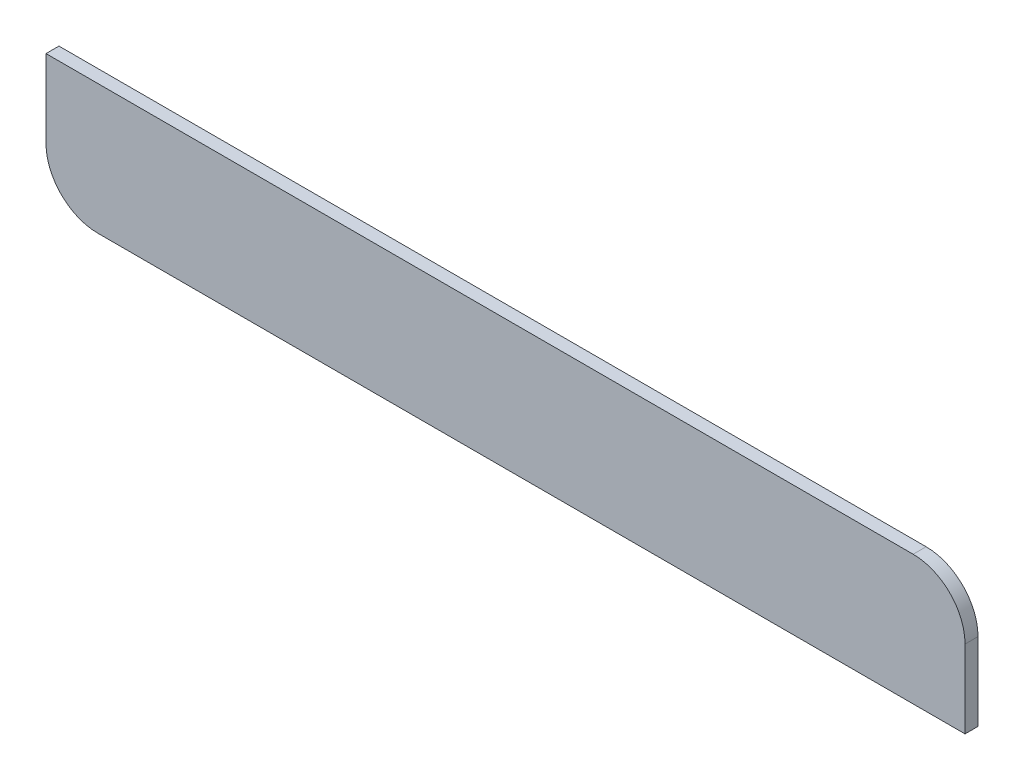
ISO-10303-21;
HEADER;
FILE_DESCRIPTION(('STEP AP214'),'2;1');
FILE_NAME('part.step','',(''),(''),'','','');
FILE_SCHEMA(('AUTOMOTIVE_DESIGN { 1 0 10303 214 1 1 1 1 }'));
ENDSEC;
DATA;
#1=APPLICATION_CONTEXT('core data for automotive mechanical design processes');
#2=APPLICATION_PROTOCOL_DEFINITION('international standard','automotive_design',2000,#1);
#3=PRODUCT_CONTEXT('',#1,'mechanical');
#4=PRODUCT('Part','Part','',(#3));
#5=PRODUCT_RELATED_PRODUCT_CATEGORY('part','',(#4));
#6=PRODUCT_DEFINITION_FORMATION('','',#4);
#7=PRODUCT_DEFINITION_CONTEXT('part definition',#1,'design');
#8=PRODUCT_DEFINITION('design','',#6,#7);
#9=PRODUCT_DEFINITION_SHAPE('','',#8);
#10=(LENGTH_UNIT() NAMED_UNIT(*) SI_UNIT(.MILLI.,.METRE.));
#11=(NAMED_UNIT(*) PLANE_ANGLE_UNIT() SI_UNIT($,.RADIAN.));
#12=(NAMED_UNIT(*) SI_UNIT($,.STERADIAN.) SOLID_ANGLE_UNIT());
#13=UNCERTAINTY_MEASURE_WITH_UNIT(LENGTH_MEASURE(1.E-05),#10,'distance_accuracy_value','');
#14=(GEOMETRIC_REPRESENTATION_CONTEXT(3) GLOBAL_UNCERTAINTY_ASSIGNED_CONTEXT((#13)) GLOBAL_UNIT_ASSIGNED_CONTEXT((#10,
#11,#12)) REPRESENTATION_CONTEXT('',''));
#15=CARTESIAN_POINT('',(0.,0.,0.));
#16=DIRECTION('',(0.,0.,1.));
#17=DIRECTION('',(1.,0.,0.));
#18=AXIS2_PLACEMENT_3D('',#15,#16,#17);
#19=CARTESIAN_POINT('',(-60.6822478351427,-10.1215045842068,6.35));
#20=DIRECTION('',(1.,0.,0.));
#21=DIRECTION('',(0.,0.,-1.));
#22=AXIS2_PLACEMENT_3D('',#19,#20,#21);
#23=PLANE('',#22);
#24=DIRECTION('',(0.,-1.,0.));
#25=VECTOR('',#24,1.);
#26=CARTESIAN_POINT('',(-60.6822478351427,-10.1215045842068,0.));
#27=LINE('',#26,#25);
#28=CARTESIAN_POINT('',(-60.6822478351427,-10.1215045842068,0.));
#29=VERTEX_POINT('',#28);
#30=CARTESIAN_POINT('',(-60.6822478351427,-48.2215045842066,0.));
#31=VERTEX_POINT('',#30);
#32=EDGE_CURVE('E116',#29,#31,#27,.T.);
#33=ORIENTED_EDGE('',*,*,#32,.T.);
#34=DIRECTION('',(0.,0.,-1.));
#35=VECTOR('',#34,1.);
#36=CARTESIAN_POINT('',(-60.6822478351427,-48.2215045842066,6.35));
#37=LINE('',#36,#35);
#38=CARTESIAN_POINT('',(-60.6822478351427,-48.2215045842066,6.35));
#39=VERTEX_POINT('',#38);
#40=EDGE_CURVE('E11',#39,#31,#37,.T.);
#41=ORIENTED_EDGE('',*,*,#40,.F.);
#42=DIRECTION('',(0.,-1.,0.));
#43=VECTOR('',#42,1.);
#44=CARTESIAN_POINT('',(-60.6822478351427,-10.1215045842068,6.35));
#45=LINE('',#44,#43);
#46=CARTESIAN_POINT('',(-60.6822478351427,-10.1215045842068,6.35));
#47=VERTEX_POINT('',#46);
#48=EDGE_CURVE('E126',#47,#39,#45,.T.);
#49=ORIENTED_EDGE('',*,*,#48,.F.);
#50=DIRECTION('',(0.,0.,-1.));
#51=VECTOR('',#50,1.);
#52=CARTESIAN_POINT('',(-60.6822478351427,-10.1215045842068,6.35));
#53=LINE('',#52,#51);
#54=EDGE_CURVE('E112',#47,#29,#53,.T.);
#55=ORIENTED_EDGE('',*,*,#54,.T.);
#56=EDGE_LOOP('',(#33,#41,#49,#55));
#57=FACE_BOUND('',#56,.T.);
#58=ADVANCED_FACE('F32',(#57),#23,.F.);
#59=CARTESIAN_POINT('',(-35.2822478351427,-48.2215045842068,6.35));
#60=DIRECTION('',(0.,0.,-1.));
#61=DIRECTION('',(-1.,0.,0.));
#62=AXIS2_PLACEMENT_3D('',#59,#60,#61);
#63=CYLINDRICAL_SURFACE('',#62,25.4);
#64=CARTESIAN_POINT('',(-35.2822478351427,-48.2215045842068,0.));
#65=DIRECTION('',(0.,0.,1.));
#66=DIRECTION('',(-1.,0.,0.));
#67=AXIS2_PLACEMENT_3D('',#64,#65,#66);
#68=CIRCLE('',#67,25.4);
#69=CARTESIAN_POINT('',(-35.2822478351425,-73.6215045842068,0.));
#70=VERTEX_POINT('',#69);
#71=EDGE_CURVE('E119',#31,#70,#68,.T.);
#72=ORIENTED_EDGE('',*,*,#71,.T.);
#73=DIRECTION('',(0.,0.,-1.));
#74=VECTOR('',#73,1.);
#75=CARTESIAN_POINT('',(-35.2822478351425,-73.6215045842068,6.35));
#76=LINE('',#75,#74);
#77=CARTESIAN_POINT('',(-35.2822478351425,-73.6215045842068,6.35));
#78=VERTEX_POINT('',#77);
#79=EDGE_CURVE('E40',#78,#70,#76,.T.);
#80=ORIENTED_EDGE('',*,*,#79,.F.);
#81=CARTESIAN_POINT('',(-35.2822478351427,-48.2215045842068,6.35));
#82=DIRECTION('',(0.,0.,1.));
#83=DIRECTION('',(-1.,0.,0.));
#84=AXIS2_PLACEMENT_3D('',#81,#82,#83);
#85=CIRCLE('',#84,25.4);
#86=EDGE_CURVE('E85',#39,#78,#85,.T.);
#87=ORIENTED_EDGE('',*,*,#86,.F.);
#88=ORIENTED_EDGE('',*,*,#40,.T.);
#89=EDGE_LOOP('',(#72,#80,#87,#88));
#90=FACE_BOUND('',#89,.T.);
#91=ADVANCED_FACE('F150',(#90),#63,.T.);
#92=CARTESIAN_POINT('',(-35.2822478351425,-73.6215045842068,6.35));
#93=DIRECTION('',(0.,1.,0.));
#94=DIRECTION('',(-1.,0.,0.));
#95=AXIS2_PLACEMENT_3D('',#92,#93,#94);
#96=PLANE('',#95);
#97=DIRECTION('',(1.,0.,0.));
#98=VECTOR('',#97,1.);
#99=CARTESIAN_POINT('',(-35.2822478351425,-73.6215045842068,0.));
#100=LINE('',#99,#98);
#101=CARTESIAN_POINT('',(389.317752164857,-73.6215045842068,0.));
#102=VERTEX_POINT('',#101);
#103=EDGE_CURVE('E121',#70,#102,#100,.T.);
#104=ORIENTED_EDGE('',*,*,#103,.T.);
#105=DIRECTION('',(0.,0.,-1.));
#106=VECTOR('',#105,1.);
#107=CARTESIAN_POINT('',(389.317752164857,-73.6215045842068,6.35));
#108=LINE('',#107,#106);
#109=CARTESIAN_POINT('',(389.317752164857,-73.6215045842068,6.35));
#110=VERTEX_POINT('',#109);
#111=EDGE_CURVE('E107',#110,#102,#108,.T.);
#112=ORIENTED_EDGE('',*,*,#111,.F.);
#113=DIRECTION('',(1.,0.,0.));
#114=VECTOR('',#113,1.);
#115=CARTESIAN_POINT('',(-35.2822478351425,-73.6215045842068,6.35));
#116=LINE('',#115,#114);
#117=EDGE_CURVE('E98',#78,#110,#116,.T.);
#118=ORIENTED_EDGE('',*,*,#117,.F.);
#119=ORIENTED_EDGE('',*,*,#79,.T.);
#120=EDGE_LOOP('',(#104,#112,#118,#119));
#121=FACE_BOUND('',#120,.T.);
#122=ADVANCED_FACE('F132',(#121),#96,.F.);
#123=CARTESIAN_POINT('',(389.317752164857,-35.5215045842068,6.35));
#124=DIRECTION('',(-1.,0.,0.));
#125=DIRECTION('',(0.,-1.,0.));
#126=AXIS2_PLACEMENT_3D('',#123,#124,#125);
#127=PLANE('',#126);
#128=DIRECTION('',(0.,1.,0.));
#129=VECTOR('',#128,1.);
#130=CARTESIAN_POINT('',(389.317752164857,-35.5215045842068,0.));
#131=LINE('',#130,#129);
#132=CARTESIAN_POINT('',(389.317752164857,-35.5215045842068,0.));
#133=VERTEX_POINT('',#132);
#134=EDGE_CURVE('E106',#102,#133,#131,.T.);
#135=ORIENTED_EDGE('',*,*,#134,.T.);
#136=DIRECTION('',(0.,0.,-1.));
#137=VECTOR('',#136,1.);
#138=CARTESIAN_POINT('',(389.317752164857,-35.5215045842068,6.35));
#139=LINE('',#138,#137);
#140=CARTESIAN_POINT('',(389.317752164857,-35.5215045842068,6.35));
#141=VERTEX_POINT('',#140);
#142=EDGE_CURVE('E103',#141,#133,#139,.T.);
#143=ORIENTED_EDGE('',*,*,#142,.F.);
#144=DIRECTION('',(0.,1.,0.));
#145=VECTOR('',#144,1.);
#146=CARTESIAN_POINT('',(389.317752164857,-35.5215045842068,6.35));
#147=LINE('',#146,#145);
#148=EDGE_CURVE('E92',#110,#141,#147,.T.);
#149=ORIENTED_EDGE('',*,*,#148,.F.);
#150=ORIENTED_EDGE('',*,*,#111,.T.);
#151=EDGE_LOOP('',(#135,#143,#149,#150));
#152=FACE_BOUND('',#151,.T.);
#153=ADVANCED_FACE('F104',(#152),#127,.F.);
#154=CARTESIAN_POINT('',(363.917752164857,-35.5215045842068,6.35));
#155=DIRECTION('',(0.,0.,-1.));
#156=DIRECTION('',(-1.,0.,0.));
#157=AXIS2_PLACEMENT_3D('',#154,#155,#156);
#158=CYLINDRICAL_SURFACE('',#157,25.4);
#159=CARTESIAN_POINT('',(363.917752164857,-35.5215045842068,0.));
#160=DIRECTION('',(0.,0.,1.));
#161=DIRECTION('',(1.,0.,0.));
#162=AXIS2_PLACEMENT_3D('',#159,#160,#161);
#163=CIRCLE('',#162,25.4);
#164=CARTESIAN_POINT('',(363.917752164857,-10.1215045842068,0.));
#165=VERTEX_POINT('',#164);
#166=EDGE_CURVE('E71',#133,#165,#163,.T.);
#167=ORIENTED_EDGE('',*,*,#166,.T.);
#168=DIRECTION('',(0.,0.,-1.));
#169=VECTOR('',#168,1.);
#170=CARTESIAN_POINT('',(363.917752164857,-10.1215045842068,6.35));
#171=LINE('',#170,#169);
#172=CARTESIAN_POINT('',(363.917752164857,-10.1215045842068,6.35));
#173=VERTEX_POINT('',#172);
#174=EDGE_CURVE('E108',#173,#165,#171,.T.);
#175=ORIENTED_EDGE('',*,*,#174,.F.);
#176=CARTESIAN_POINT('',(363.917752164857,-35.5215045842068,6.35));
#177=DIRECTION('',(0.,0.,1.));
#178=DIRECTION('',(1.,0.,0.));
#179=AXIS2_PLACEMENT_3D('',#176,#177,#178);
#180=CIRCLE('',#179,25.4);
#181=EDGE_CURVE('E96',#141,#173,#180,.T.);
#182=ORIENTED_EDGE('',*,*,#181,.F.);
#183=ORIENTED_EDGE('',*,*,#142,.T.);
#184=EDGE_LOOP('',(#167,#175,#182,#183));
#185=FACE_BOUND('',#184,.T.);
#186=ADVANCED_FACE('F110',(#185),#158,.T.);
#187=CARTESIAN_POINT('',(-60.6822478351427,-10.1215045842068,6.35));
#188=DIRECTION('',(0.,-1.,0.));
#189=DIRECTION('',(0.,0.,-1.));
#190=AXIS2_PLACEMENT_3D('',#187,#188,#189);
#191=PLANE('',#190);
#192=DIRECTION('',(-1.,0.,0.));
#193=VECTOR('',#192,1.);
#194=CARTESIAN_POINT('',(-60.6822478351427,-10.1215045842068,0.));
#195=LINE('',#194,#193);
#196=EDGE_CURVE('E77',#165,#29,#195,.T.);
#197=ORIENTED_EDGE('',*,*,#196,.T.);
#198=ORIENTED_EDGE('',*,*,#54,.F.);
#199=DIRECTION('',(-1.,0.,0.));
#200=VECTOR('',#199,1.);
#201=CARTESIAN_POINT('',(-60.6822478351427,-10.1215045842068,6.35));
#202=LINE('',#201,#200);
#203=EDGE_CURVE('E48',#173,#47,#202,.T.);
#204=ORIENTED_EDGE('',*,*,#203,.F.);
#205=ORIENTED_EDGE('',*,*,#174,.T.);
#206=EDGE_LOOP('',(#197,#198,#204,#205));
#207=FACE_BOUND('',#206,.T.);
#208=ADVANCED_FACE('F139',(#207),#191,.F.);
#209=CARTESIAN_POINT('',(-35.2822478351427,-48.2215045842068,6.35));
#210=DIRECTION('',(0.,0.,-1.));
#211=DIRECTION('',(-1.,0.,0.));
#212=AXIS2_PLACEMENT_3D('',#209,#210,#211);
#213=PLANE('',#212);
#214=ORIENTED_EDGE('',*,*,#48,.T.);
#215=ORIENTED_EDGE('',*,*,#86,.T.);
#216=ORIENTED_EDGE('',*,*,#117,.T.);
#217=ORIENTED_EDGE('',*,*,#148,.T.);
#218=ORIENTED_EDGE('',*,*,#181,.T.);
#219=ORIENTED_EDGE('',*,*,#203,.T.);
#220=EDGE_LOOP('',(#214,#215,#216,#217,#218,#219));
#221=FACE_BOUND('',#220,.T.);
#222=ADVANCED_FACE('F94',(#221),#213,.F.);
#223=CARTESIAN_POINT('',(-35.2822478351427,-48.2215045842068,0.));
#224=DIRECTION('',(0.,0.,-1.));
#225=DIRECTION('',(-1.,0.,0.));
#226=AXIS2_PLACEMENT_3D('',#223,#224,#225);
#227=PLANE('',#226);
#228=ORIENTED_EDGE('',*,*,#32,.F.);
#229=ORIENTED_EDGE('',*,*,#196,.F.);
#230=ORIENTED_EDGE('',*,*,#166,.F.);
#231=ORIENTED_EDGE('',*,*,#134,.F.);
#232=ORIENTED_EDGE('',*,*,#103,.F.);
#233=ORIENTED_EDGE('',*,*,#71,.F.);
#234=EDGE_LOOP('',(#228,#229,#230,#231,#232,#233));
#235=FACE_BOUND('',#234,.T.);
#236=ADVANCED_FACE('F135',(#235),#227,.T.);
#237=CLOSED_SHELL('',(#58,#91,#122,#153,#186,#208,#222,#236));
#238=MANIFOLD_SOLID_BREP('B2',#237);
#239=ADVANCED_BREP_SHAPE_REPRESENTATION('',(#18,#238),#14);
#240=SHAPE_DEFINITION_REPRESENTATION(#9,#239);
ENDSEC;
END-ISO-10303-21;
